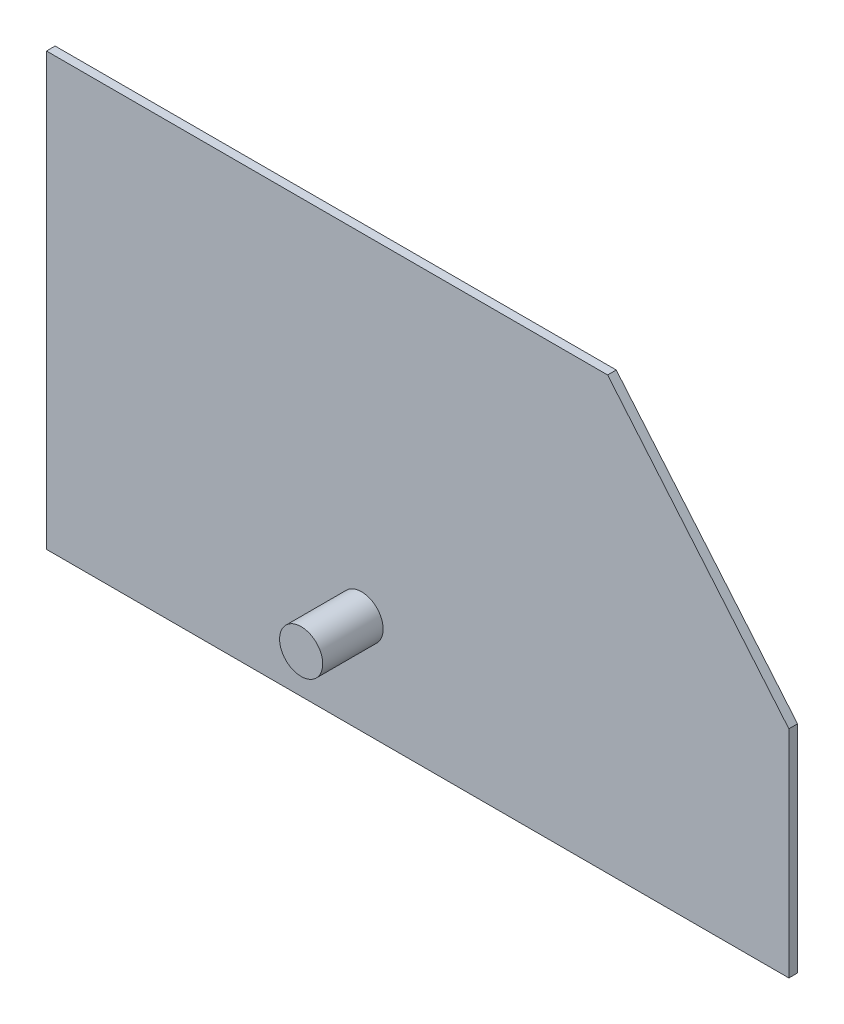
ISO-10303-21;
HEADER;
FILE_DESCRIPTION(('STEP AP214'),'2;1');
FILE_NAME('part.step','',(''),(''),'','','');
FILE_SCHEMA(('AUTOMOTIVE_DESIGN { 1 0 10303 214 1 1 1 1 }'));
ENDSEC;
DATA;
#1=APPLICATION_CONTEXT('core data for automotive mechanical design processes');
#2=APPLICATION_PROTOCOL_DEFINITION('international standard','automotive_design',2000,#1);
#3=PRODUCT_CONTEXT('',#1,'mechanical');
#4=PRODUCT('Part','Part','',(#3));
#5=PRODUCT_RELATED_PRODUCT_CATEGORY('part','',(#4));
#6=PRODUCT_DEFINITION_FORMATION('','',#4);
#7=PRODUCT_DEFINITION_CONTEXT('part definition',#1,'design');
#8=PRODUCT_DEFINITION('design','',#6,#7);
#9=PRODUCT_DEFINITION_SHAPE('','',#8);
#10=(LENGTH_UNIT() NAMED_UNIT(*) SI_UNIT(.MILLI.,.METRE.));
#11=(NAMED_UNIT(*) PLANE_ANGLE_UNIT() SI_UNIT($,.RADIAN.));
#12=(NAMED_UNIT(*) SI_UNIT($,.STERADIAN.) SOLID_ANGLE_UNIT());
#13=UNCERTAINTY_MEASURE_WITH_UNIT(LENGTH_MEASURE(1.E-05),#10,'distance_accuracy_value','');
#14=(GEOMETRIC_REPRESENTATION_CONTEXT(3) GLOBAL_UNCERTAINTY_ASSIGNED_CONTEXT((#13)) GLOBAL_UNIT_ASSIGNED_CONTEXT((#10,
#11,#12)) REPRESENTATION_CONTEXT('',''));
#15=CARTESIAN_POINT('',(0.,0.,0.));
#16=DIRECTION('',(0.,0.,1.));
#17=DIRECTION('',(1.,0.,0.));
#18=AXIS2_PLACEMENT_3D('',#15,#16,#17);
#19=CARTESIAN_POINT('',(0.,50.,1.));
#20=DIRECTION('',(1.,0.,0.));
#21=DIRECTION('',(0.,1.,0.));
#22=AXIS2_PLACEMENT_3D('',#19,#20,#21);
#23=PLANE('',#22);
#24=DIRECTION('',(0.,-1.,0.));
#25=VECTOR('',#24,1.);
#26=CARTESIAN_POINT('',(0.,50.,0.));
#27=LINE('',#26,#25);
#28=CARTESIAN_POINT('',(0.,50.,0.));
#29=VERTEX_POINT('',#28);
#30=CARTESIAN_POINT('',(0.,0.,0.));
#31=VERTEX_POINT('',#30);
#32=EDGE_CURVE('E111',#29,#31,#27,.T.);
#33=ORIENTED_EDGE('',*,*,#32,.T.);
#34=DIRECTION('',(0.,0.,-1.));
#35=VECTOR('',#34,1.);
#36=CARTESIAN_POINT('',(0.,0.,1.));
#37=LINE('',#36,#35);
#38=CARTESIAN_POINT('',(0.,0.,1.));
#39=VERTEX_POINT('',#38);
#40=EDGE_CURVE('E11',#39,#31,#37,.T.);
#41=ORIENTED_EDGE('',*,*,#40,.F.);
#42=DIRECTION('',(0.,-1.,0.));
#43=VECTOR('',#42,1.);
#44=CARTESIAN_POINT('',(0.,50.,1.));
#45=LINE('',#44,#43);
#46=CARTESIAN_POINT('',(0.,50.,1.));
#47=VERTEX_POINT('',#46);
#48=EDGE_CURVE('E120',#47,#39,#45,.T.);
#49=ORIENTED_EDGE('',*,*,#48,.F.);
#50=DIRECTION('',(0.,0.,-1.));
#51=VECTOR('',#50,1.);
#52=CARTESIAN_POINT('',(0.,50.,1.));
#53=LINE('',#52,#51);
#54=EDGE_CURVE('E107',#47,#29,#53,.T.);
#55=ORIENTED_EDGE('',*,*,#54,.T.);
#56=EDGE_LOOP('',(#33,#41,#49,#55));
#57=FACE_BOUND('',#56,.T.);
#58=ADVANCED_FACE('F37',(#57),#23,.F.);
#59=CARTESIAN_POINT('',(0.,0.,1.));
#60=DIRECTION('',(0.,1.,0.));
#61=DIRECTION('',(0.,0.,1.));
#62=AXIS2_PLACEMENT_3D('',#59,#60,#61);
#63=PLANE('',#62);
#64=DIRECTION('',(1.,0.,0.));
#65=VECTOR('',#64,1.);
#66=CARTESIAN_POINT('',(0.,0.,0.));
#67=LINE('',#66,#65);
#68=CARTESIAN_POINT('',(86.,0.,0.));
#69=VERTEX_POINT('',#68);
#70=EDGE_CURVE('E114',#31,#69,#67,.T.);
#71=ORIENTED_EDGE('',*,*,#70,.T.);
#72=DIRECTION('',(0.,0.,-1.));
#73=VECTOR('',#72,1.);
#74=CARTESIAN_POINT('',(86.,0.,1.));
#75=LINE('',#74,#73);
#76=CARTESIAN_POINT('',(86.,0.,1.));
#77=VERTEX_POINT('',#76);
#78=EDGE_CURVE('E45',#77,#69,#75,.T.);
#79=ORIENTED_EDGE('',*,*,#78,.F.);
#80=DIRECTION('',(1.,0.,0.));
#81=VECTOR('',#80,1.);
#82=CARTESIAN_POINT('',(0.,0.,1.));
#83=LINE('',#82,#81);
#84=EDGE_CURVE('E87',#39,#77,#83,.T.);
#85=ORIENTED_EDGE('',*,*,#84,.F.);
#86=ORIENTED_EDGE('',*,*,#40,.T.);
#87=EDGE_LOOP('',(#71,#79,#85,#86));
#88=FACE_BOUND('',#87,.T.);
#89=ADVANCED_FACE('F140',(#88),#63,.F.);
#90=CARTESIAN_POINT('',(86.,0.,1.));
#91=DIRECTION('',(-1.,0.,0.));
#92=DIRECTION('',(0.,0.,1.));
#93=AXIS2_PLACEMENT_3D('',#90,#91,#92);
#94=PLANE('',#93);
#95=DIRECTION('',(0.,1.,0.));
#96=VECTOR('',#95,1.);
#97=CARTESIAN_POINT('',(86.,0.,0.));
#98=LINE('',#97,#96);
#99=CARTESIAN_POINT('',(86.,25.,0.));
#100=VERTEX_POINT('',#99);
#101=EDGE_CURVE('E102',#69,#100,#98,.T.);
#102=ORIENTED_EDGE('',*,*,#101,.T.);
#103=DIRECTION('',(0.,0.,-1.));
#104=VECTOR('',#103,1.);
#105=CARTESIAN_POINT('',(86.,25.,1.));
#106=LINE('',#105,#104);
#107=CARTESIAN_POINT('',(86.,25.,1.));
#108=VERTEX_POINT('',#107);
#109=EDGE_CURVE('E99',#108,#100,#106,.T.);
#110=ORIENTED_EDGE('',*,*,#109,.F.);
#111=DIRECTION('',(0.,1.,0.));
#112=VECTOR('',#111,1.);
#113=CARTESIAN_POINT('',(86.,0.,1.));
#114=LINE('',#113,#112);
#115=EDGE_CURVE('E91',#77,#108,#114,.T.);
#116=ORIENTED_EDGE('',*,*,#115,.F.);
#117=ORIENTED_EDGE('',*,*,#78,.T.);
#118=EDGE_LOOP('',(#102,#110,#116,#117));
#119=FACE_BOUND('',#118,.T.);
#120=ADVANCED_FACE('F100',(#119),#94,.F.);
#121=CARTESIAN_POINT('',(86.,25.,1.));
#122=DIRECTION('',(-0.765704864789611,-0.643192086423273,0.));
#123=DIRECTION('',(0.643192086423273,-0.765704864789611,0.));
#124=AXIS2_PLACEMENT_3D('',#121,#122,#123);
#125=PLANE('',#124);
#126=DIRECTION('',(-0.643192086423273,0.765704864789611,0.));
#127=VECTOR('',#126,1.);
#128=CARTESIAN_POINT('',(86.,25.,0.));
#129=LINE('',#128,#127);
#130=CARTESIAN_POINT('',(65.,50.,0.));
#131=VERTEX_POINT('',#130);
#132=EDGE_CURVE('E73',#100,#131,#129,.T.);
#133=ORIENTED_EDGE('',*,*,#132,.T.);
#134=DIRECTION('',(0.,0.,-1.));
#135=VECTOR('',#134,1.);
#136=CARTESIAN_POINT('',(65.,50.,1.));
#137=LINE('',#136,#135);
#138=CARTESIAN_POINT('',(65.,50.,1.));
#139=VERTEX_POINT('',#138);
#140=EDGE_CURVE('E103',#139,#131,#137,.T.);
#141=ORIENTED_EDGE('',*,*,#140,.F.);
#142=DIRECTION('',(-0.643192086423273,0.765704864789611,0.));
#143=VECTOR('',#142,1.);
#144=CARTESIAN_POINT('',(86.,25.,1.));
#145=LINE('',#144,#143);
#146=EDGE_CURVE('E95',#108,#139,#145,.T.);
#147=ORIENTED_EDGE('',*,*,#146,.F.);
#148=ORIENTED_EDGE('',*,*,#109,.T.);
#149=EDGE_LOOP('',(#133,#141,#147,#148));
#150=FACE_BOUND('',#149,.T.);
#151=ADVANCED_FACE('F105',(#150),#125,.F.);
#152=CARTESIAN_POINT('',(65.,50.,1.));
#153=DIRECTION('',(0.,-1.,0.));
#154=DIRECTION('',(1.,0.,0.));
#155=AXIS2_PLACEMENT_3D('',#152,#153,#154);
#156=PLANE('',#155);
#157=DIRECTION('',(-1.,0.,0.));
#158=VECTOR('',#157,1.);
#159=CARTESIAN_POINT('',(65.,50.,0.));
#160=LINE('',#159,#158);
#161=EDGE_CURVE('E79',#131,#29,#160,.T.);
#162=ORIENTED_EDGE('',*,*,#161,.T.);
#163=ORIENTED_EDGE('',*,*,#54,.F.);
#164=DIRECTION('',(-1.,0.,0.));
#165=VECTOR('',#164,1.);
#166=CARTESIAN_POINT('',(65.,50.,1.));
#167=LINE('',#166,#165);
#168=EDGE_CURVE('E53',#139,#47,#167,.T.);
#169=ORIENTED_EDGE('',*,*,#168,.F.);
#170=ORIENTED_EDGE('',*,*,#140,.T.);
#171=EDGE_LOOP('',(#162,#163,#169,#170));
#172=FACE_BOUND('',#171,.T.);
#173=ADVANCED_FACE('F128',(#172),#156,.F.);
#174=CARTESIAN_POINT('',(0.,0.,1.));
#175=DIRECTION('',(0.,0.,1.));
#176=DIRECTION('',(1.,0.,0.));
#177=AXIS2_PLACEMENT_3D('',#174,#175,#176);
#178=PLANE('',#177);
#179=CARTESIAN_POINT('',(36.5,11.5,1.));
#180=DIRECTION('',(0.,0.,1.));
#181=DIRECTION('',(1.,0.,0.));
#182=AXIS2_PLACEMENT_3D('',#179,#180,#181);
#183=CIRCLE('',#182,2.5);
#184=CARTESIAN_POINT('',(39.,11.5,1.));
#185=VERTEX_POINT('',#184);
#186=EDGE_CURVE('E225',#185,#185,#183,.T.);
#187=ORIENTED_EDGE('',*,*,#186,.F.);
#188=EDGE_LOOP('',(#187));
#189=FACE_BOUND('',#188,.T.);
#190=ORIENTED_EDGE('',*,*,#48,.T.);
#191=ORIENTED_EDGE('',*,*,#84,.T.);
#192=ORIENTED_EDGE('',*,*,#115,.T.);
#193=ORIENTED_EDGE('',*,*,#146,.T.);
#194=ORIENTED_EDGE('',*,*,#168,.T.);
#195=EDGE_LOOP('',(#190,#191,#192,#193,#194));
#196=FACE_BOUND('',#195,.T.);
#197=ADVANCED_FACE('F93',(#189,#196),#178,.T.);
#198=CARTESIAN_POINT('',(0.,0.,0.));
#199=DIRECTION('',(0.,0.,1.));
#200=DIRECTION('',(1.,0.,0.));
#201=AXIS2_PLACEMENT_3D('',#198,#199,#200);
#202=PLANE('',#201);
#203=ORIENTED_EDGE('',*,*,#32,.F.);
#204=ORIENTED_EDGE('',*,*,#161,.F.);
#205=ORIENTED_EDGE('',*,*,#132,.F.);
#206=ORIENTED_EDGE('',*,*,#101,.F.);
#207=ORIENTED_EDGE('',*,*,#70,.F.);
#208=EDGE_LOOP('',(#203,#204,#205,#206,#207));
#209=FACE_BOUND('',#208,.T.);
#210=ADVANCED_FACE('F124',(#209),#202,.F.);
#211=CARTESIAN_POINT('',(36.5,11.5,8.));
#212=DIRECTION('',(0.,0.,-1.));
#213=DIRECTION('',(-1.,0.,0.));
#214=AXIS2_PLACEMENT_3D('',#211,#212,#213);
#215=CYLINDRICAL_SURFACE('',#214,2.5);
#216=CARTESIAN_POINT('',(36.5,11.5,8.));
#217=DIRECTION('',(0.,0.,1.));
#218=DIRECTION('',(1.,0.,0.));
#219=AXIS2_PLACEMENT_3D('',#216,#217,#218);
#220=CIRCLE('',#219,2.5);
#221=CARTESIAN_POINT('',(39.,11.5,8.));
#222=VERTEX_POINT('',#221);
#223=EDGE_CURVE('E115',#222,#222,#220,.T.);
#224=ORIENTED_EDGE('',*,*,#223,.F.);
#225=EDGE_LOOP('',(#224));
#226=FACE_BOUND('',#225,.T.);
#227=ORIENTED_EDGE('',*,*,#186,.T.);
#228=EDGE_LOOP('',(#227));
#229=FACE_BOUND('',#228,.T.);
#230=ADVANCED_FACE('F170',(#226,#229),#215,.T.);
#231=CARTESIAN_POINT('',(36.5,11.5,8.));
#232=DIRECTION('',(0.,0.,1.));
#233=DIRECTION('',(1.,0.,0.));
#234=AXIS2_PLACEMENT_3D('',#231,#232,#233);
#235=PLANE('',#234);
#236=ORIENTED_EDGE('',*,*,#223,.T.);
#237=EDGE_LOOP('',(#236));
#238=FACE_BOUND('',#237,.T.);
#239=ADVANCED_FACE('F185',(#238),#235,.T.);
#240=CLOSED_SHELL('',(#58,#89,#120,#151,#173,#197,#210,#230,#239));
#241=MANIFOLD_SOLID_BREP('B2',#240);
#242=ADVANCED_BREP_SHAPE_REPRESENTATION('',(#18,#241),#14);
#243=SHAPE_DEFINITION_REPRESENTATION(#9,#242);
ENDSEC;
END-ISO-10303-21;
